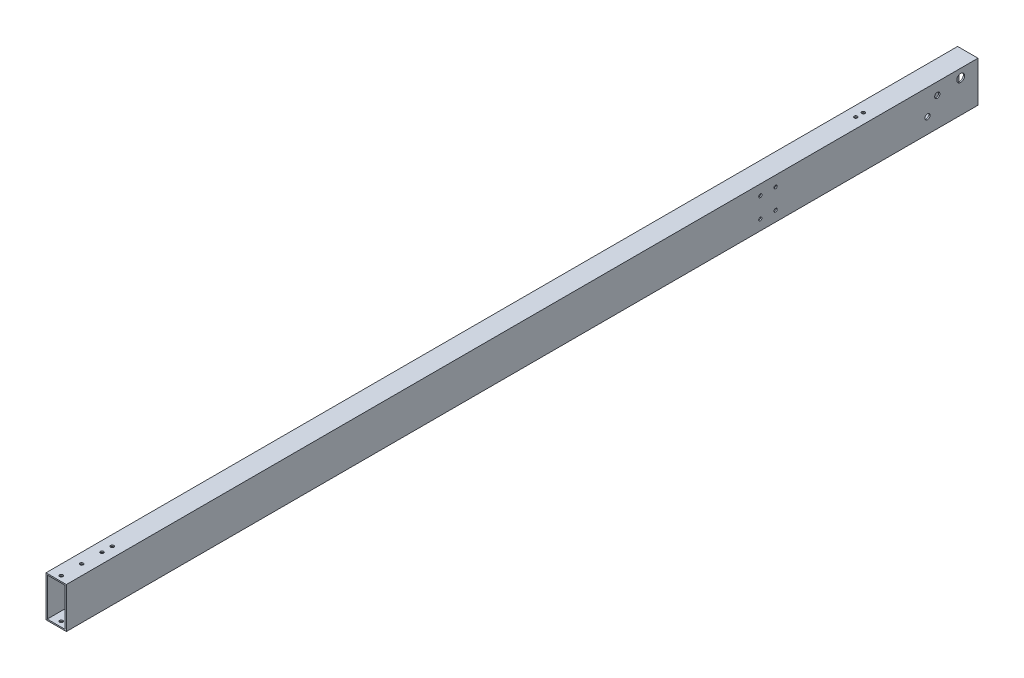
ISO-10303-21;
HEADER;
FILE_DESCRIPTION(('STEP AP214'),'2;1');
FILE_NAME('part.step','',(''),(''),'','','');
FILE_SCHEMA(('AUTOMOTIVE_DESIGN { 1 0 10303 214 1 1 1 1 }'));
ENDSEC;
DATA;
#1=APPLICATION_CONTEXT('core data for automotive mechanical design processes');
#2=APPLICATION_PROTOCOL_DEFINITION('international standard','automotive_design',2000,#1);
#3=PRODUCT_CONTEXT('',#1,'mechanical');
#4=PRODUCT('Part','Part','',(#3));
#5=PRODUCT_RELATED_PRODUCT_CATEGORY('part','',(#4));
#6=PRODUCT_DEFINITION_FORMATION('','',#4);
#7=PRODUCT_DEFINITION_CONTEXT('part definition',#1,'design');
#8=PRODUCT_DEFINITION('design','',#6,#7);
#9=PRODUCT_DEFINITION_SHAPE('','',#8);
#10=(LENGTH_UNIT() NAMED_UNIT(*) SI_UNIT(.MILLI.,.METRE.));
#11=(NAMED_UNIT(*) PLANE_ANGLE_UNIT() SI_UNIT($,.RADIAN.));
#12=(NAMED_UNIT(*) SI_UNIT($,.STERADIAN.) SOLID_ANGLE_UNIT());
#13=UNCERTAINTY_MEASURE_WITH_UNIT(LENGTH_MEASURE(1.E-05),#10,'distance_accuracy_value','');
#14=(GEOMETRIC_REPRESENTATION_CONTEXT(3) GLOBAL_UNCERTAINTY_ASSIGNED_CONTEXT((#13)) GLOBAL_UNIT_ASSIGNED_CONTEXT((#10,
#11,#12)) REPRESENTATION_CONTEXT('',''));
#15=CARTESIAN_POINT('',(0.,0.,0.));
#16=DIRECTION('',(0.,0.,1.));
#17=DIRECTION('',(1.,0.,0.));
#18=AXIS2_PLACEMENT_3D('',#15,#16,#17);
#19=CARTESIAN_POINT('',(0.,40.2844,21.59));
#20=DIRECTION('',(1.,0.,0.));
#21=DIRECTION('',(0.,0.,-1.));
#22=AXIS2_PLACEMENT_3D('',#19,#20,#21);
#23=CYLINDRICAL_SURFACE('',#22,4.9022);
#24=CARTESIAN_POINT('',(25.4,40.2844,21.59));
#25=DIRECTION('',(1.,0.,0.));
#26=DIRECTION('',(0.,0.,-1.));
#27=AXIS2_PLACEMENT_3D('',#24,#25,#26);
#28=CIRCLE('',#27,4.9022);
#29=CARTESIAN_POINT('',(25.4,40.2844,16.6878));
#30=VERTEX_POINT('',#29);
#31=EDGE_CURVE('E20',#30,#30,#28,.F.);
#32=ORIENTED_EDGE('',*,*,#31,.F.);
#33=EDGE_LOOP('',(#32));
#34=FACE_BOUND('',#33,.T.);
#35=CARTESIAN_POINT('',(23.8125,40.2844,21.59));
#36=DIRECTION('',(1.,0.,0.));
#37=DIRECTION('',(0.,0.,-1.));
#38=AXIS2_PLACEMENT_3D('',#35,#36,#37);
#39=CIRCLE('',#38,4.9022);
#40=CARTESIAN_POINT('',(23.8125,40.2844,16.6878));
#41=VERTEX_POINT('',#40);
#42=EDGE_CURVE('E253',#41,#41,#39,.F.);
#43=ORIENTED_EDGE('',*,*,#42,.T.);
#44=EDGE_LOOP('',(#43));
#45=FACE_BOUND('',#44,.T.);
#46=ADVANCED_FACE('F17',(#34,#45),#23,.F.);
#47=CARTESIAN_POINT('',(13.3600000001,19.05,62.992));
#48=DIRECTION('',(1.,0.,0.));
#49=DIRECTION('',(0.,0.,-1.));
#50=AXIS2_PLACEMENT_3D('',#47,#48,#49);
#51=CYLINDRICAL_SURFACE('',#50,3.2639);
#52=CARTESIAN_POINT('',(25.4,19.05,62.992));
#53=DIRECTION('',(1.,0.,0.));
#54=DIRECTION('',(0.,0.,-1.));
#55=AXIS2_PLACEMENT_3D('',#52,#53,#54);
#56=CIRCLE('',#55,3.2639);
#57=CARTESIAN_POINT('',(25.4,19.05,59.7281));
#58=VERTEX_POINT('',#57);
#59=EDGE_CURVE('E270',#58,#58,#56,.F.);
#60=ORIENTED_EDGE('',*,*,#59,.F.);
#61=EDGE_LOOP('',(#60));
#62=FACE_BOUND('',#61,.T.);
#63=CARTESIAN_POINT('',(23.8125,19.05,62.992));
#64=DIRECTION('',(1.,0.,0.));
#65=DIRECTION('',(0.,0.,-1.));
#66=AXIS2_PLACEMENT_3D('',#63,#64,#65);
#67=CIRCLE('',#66,3.2639);
#68=CARTESIAN_POINT('',(23.8125,19.05,59.7281));
#69=VERTEX_POINT('',#68);
#70=EDGE_CURVE('E250',#69,#69,#67,.F.);
#71=ORIENTED_EDGE('',*,*,#70,.T.);
#72=EDGE_LOOP('',(#71));
#73=FACE_BOUND('',#72,.T.);
#74=ADVANCED_FACE('F282',(#62,#73),#51,.F.);
#75=CARTESIAN_POINT('',(13.3600000001,36.1188,50.8));
#76=DIRECTION('',(1.,0.,0.));
#77=DIRECTION('',(0.,0.,-1.));
#78=AXIS2_PLACEMENT_3D('',#75,#76,#77);
#79=CYLINDRICAL_SURFACE('',#78,3.2639);
#80=CARTESIAN_POINT('',(25.4,36.1188,50.8));
#81=DIRECTION('',(1.,0.,0.));
#82=DIRECTION('',(0.,0.,-1.));
#83=AXIS2_PLACEMENT_3D('',#80,#81,#82);
#84=CIRCLE('',#83,3.2639);
#85=CARTESIAN_POINT('',(25.4,36.1188,47.5361));
#86=VERTEX_POINT('',#85);
#87=EDGE_CURVE('E268',#86,#86,#84,.F.);
#88=ORIENTED_EDGE('',*,*,#87,.F.);
#89=EDGE_LOOP('',(#88));
#90=FACE_BOUND('',#89,.T.);
#91=CARTESIAN_POINT('',(23.8125,36.1188,50.8));
#92=DIRECTION('',(1.,0.,0.));
#93=DIRECTION('',(0.,0.,-1.));
#94=AXIS2_PLACEMENT_3D('',#91,#92,#93);
#95=CIRCLE('',#94,3.2639);
#96=CARTESIAN_POINT('',(23.8125,36.1188,47.5361));
#97=VERTEX_POINT('',#96);
#98=EDGE_CURVE('E247',#97,#97,#95,.F.);
#99=ORIENTED_EDGE('',*,*,#98,.T.);
#100=EDGE_LOOP('',(#99));
#101=FACE_BOUND('',#100,.T.);
#102=ADVANCED_FACE('F441',(#90,#101),#79,.F.);
#103=CARTESIAN_POINT('',(13.3600000001,12.827,271.399));
#104=DIRECTION('',(1.,0.,0.));
#105=DIRECTION('',(0.,0.,-1.));
#106=AXIS2_PLACEMENT_3D('',#103,#104,#105);
#107=CYLINDRICAL_SURFACE('',#106,2.0193);
#108=CARTESIAN_POINT('',(25.4,12.827,271.399));
#109=DIRECTION('',(1.,0.,0.));
#110=DIRECTION('',(0.,0.,-1.));
#111=AXIS2_PLACEMENT_3D('',#108,#109,#110);
#112=CIRCLE('',#111,2.0193);
#113=CARTESIAN_POINT('',(25.4,12.827,269.3797));
#114=VERTEX_POINT('',#113);
#115=EDGE_CURVE('E265',#114,#114,#112,.F.);
#116=ORIENTED_EDGE('',*,*,#115,.F.);
#117=EDGE_LOOP('',(#116));
#118=FACE_BOUND('',#117,.T.);
#119=CARTESIAN_POINT('',(23.8125,12.827,271.399));
#120=DIRECTION('',(1.,0.,0.));
#121=DIRECTION('',(0.,0.,-1.));
#122=AXIS2_PLACEMENT_3D('',#119,#120,#121);
#123=CIRCLE('',#122,2.0193);
#124=CARTESIAN_POINT('',(23.8125,12.827,269.3797));
#125=VERTEX_POINT('',#124);
#126=EDGE_CURVE('E244',#125,#125,#123,.F.);
#127=ORIENTED_EDGE('',*,*,#126,.T.);
#128=EDGE_LOOP('',(#127));
#129=FACE_BOUND('',#128,.T.);
#130=ADVANCED_FACE('F437',(#118,#129),#107,.F.);
#131=CARTESIAN_POINT('',(13.3600000001,12.827,252.349));
#132=DIRECTION('',(1.,0.,0.));
#133=DIRECTION('',(0.,0.,-1.));
#134=AXIS2_PLACEMENT_3D('',#131,#132,#133);
#135=CYLINDRICAL_SURFACE('',#134,2.0193);
#136=CARTESIAN_POINT('',(25.4,12.827,252.349));
#137=DIRECTION('',(1.,0.,0.));
#138=DIRECTION('',(0.,0.,-1.));
#139=AXIS2_PLACEMENT_3D('',#136,#137,#138);
#140=CIRCLE('',#139,2.0193);
#141=CARTESIAN_POINT('',(25.4,12.827,250.3297));
#142=VERTEX_POINT('',#141);
#143=EDGE_CURVE('E262',#142,#142,#140,.F.);
#144=ORIENTED_EDGE('',*,*,#143,.F.);
#145=EDGE_LOOP('',(#144));
#146=FACE_BOUND('',#145,.T.);
#147=CARTESIAN_POINT('',(23.8125,12.827,252.349));
#148=DIRECTION('',(1.,0.,0.));
#149=DIRECTION('',(0.,0.,-1.));
#150=AXIS2_PLACEMENT_3D('',#147,#148,#149);
#151=CIRCLE('',#150,2.0193);
#152=CARTESIAN_POINT('',(23.8125,12.827,250.3297));
#153=VERTEX_POINT('',#152);
#154=EDGE_CURVE('E241',#153,#153,#151,.F.);
#155=ORIENTED_EDGE('',*,*,#154,.T.);
#156=EDGE_LOOP('',(#155));
#157=FACE_BOUND('',#156,.T.);
#158=ADVANCED_FACE('F433',(#146,#157),#135,.F.);
#159=CARTESIAN_POINT('',(13.3600000001,37.973,271.399));
#160=DIRECTION('',(1.,0.,0.));
#161=DIRECTION('',(0.,0.,-1.));
#162=AXIS2_PLACEMENT_3D('',#159,#160,#161);
#163=CYLINDRICAL_SURFACE('',#162,2.0193);
#164=CARTESIAN_POINT('',(25.4,37.973,271.399));
#165=DIRECTION('',(1.,0.,0.));
#166=DIRECTION('',(0.,0.,-1.));
#167=AXIS2_PLACEMENT_3D('',#164,#165,#166);
#168=CIRCLE('',#167,2.0193);
#169=CARTESIAN_POINT('',(25.4,37.973,269.3797));
#170=VERTEX_POINT('',#169);
#171=EDGE_CURVE('E259',#170,#170,#168,.F.);
#172=ORIENTED_EDGE('',*,*,#171,.F.);
#173=EDGE_LOOP('',(#172));
#174=FACE_BOUND('',#173,.T.);
#175=CARTESIAN_POINT('',(23.8125,37.973,271.399));
#176=DIRECTION('',(1.,0.,0.));
#177=DIRECTION('',(0.,0.,-1.));
#178=AXIS2_PLACEMENT_3D('',#175,#176,#177);
#179=CIRCLE('',#178,2.0193);
#180=CARTESIAN_POINT('',(23.8125,37.973,269.3797));
#181=VERTEX_POINT('',#180);
#182=EDGE_CURVE('E238',#181,#181,#179,.F.);
#183=ORIENTED_EDGE('',*,*,#182,.T.);
#184=EDGE_LOOP('',(#183));
#185=FACE_BOUND('',#184,.T.);
#186=ADVANCED_FACE('F425',(#174,#185),#163,.F.);
#187=CARTESIAN_POINT('',(13.3600000001,37.973,252.349));
#188=DIRECTION('',(1.,0.,0.));
#189=DIRECTION('',(0.,0.,-1.));
#190=AXIS2_PLACEMENT_3D('',#187,#188,#189);
#191=CYLINDRICAL_SURFACE('',#190,2.0193);
#192=CARTESIAN_POINT('',(25.4,37.973,252.349));
#193=DIRECTION('',(1.,0.,0.));
#194=DIRECTION('',(0.,0.,-1.));
#195=AXIS2_PLACEMENT_3D('',#192,#193,#194);
#196=CIRCLE('',#195,2.0193);
#197=CARTESIAN_POINT('',(25.4,37.973,250.3297));
#198=VERTEX_POINT('',#197);
#199=EDGE_CURVE('E256',#198,#198,#196,.F.);
#200=ORIENTED_EDGE('',*,*,#199,.F.);
#201=EDGE_LOOP('',(#200));
#202=FACE_BOUND('',#201,.T.);
#203=CARTESIAN_POINT('',(23.8125,37.973,252.349));
#204=DIRECTION('',(1.,0.,0.));
#205=DIRECTION('',(0.,0.,-1.));
#206=AXIS2_PLACEMENT_3D('',#203,#204,#205);
#207=CIRCLE('',#206,2.0193);
#208=CARTESIAN_POINT('',(23.8125,37.973,250.3297));
#209=VERTEX_POINT('',#208);
#210=EDGE_CURVE('E99',#209,#209,#207,.F.);
#211=ORIENTED_EDGE('',*,*,#210,.T.);
#212=EDGE_LOOP('',(#211));
#213=FACE_BOUND('',#212,.T.);
#214=ADVANCED_FACE('F415',(#202,#213),#191,.F.);
#215=CARTESIAN_POINT('',(12.7,24.7399999987,1079.5));
#216=DIRECTION('',(0.,1.,0.));
#217=DIRECTION('',(0.,0.,1.));
#218=AXIS2_PLACEMENT_3D('',#215,#216,#217);
#219=CYLINDRICAL_SURFACE('',#218,2.0193);
#220=CARTESIAN_POINT('',(12.7,50.8,1079.5));
#221=DIRECTION('',(0.,1.,0.));
#222=DIRECTION('',(0.,0.,1.));
#223=AXIS2_PLACEMENT_3D('',#220,#221,#222);
#224=CIRCLE('',#223,2.0193);
#225=CARTESIAN_POINT('',(12.7,50.8,1081.5193));
#226=VERTEX_POINT('',#225);
#227=EDGE_CURVE('E119',#226,#226,#224,.F.);
#228=ORIENTED_EDGE('',*,*,#227,.F.);
#229=EDGE_LOOP('',(#228));
#230=FACE_BOUND('',#229,.T.);
#231=CARTESIAN_POINT('',(12.7,49.2125,1079.5));
#232=DIRECTION('',(0.,1.,0.));
#233=DIRECTION('',(0.,0.,1.));
#234=AXIS2_PLACEMENT_3D('',#231,#232,#233);
#235=CIRCLE('',#234,2.0193);
#236=CARTESIAN_POINT('',(12.7,49.2125,1081.5193));
#237=VERTEX_POINT('',#236);
#238=EDGE_CURVE('E125',#237,#237,#235,.T.);
#239=ORIENTED_EDGE('',*,*,#238,.F.);
#240=EDGE_LOOP('',(#239));
#241=FACE_BOUND('',#240,.T.);
#242=ADVANCED_FACE('F412',(#230,#241),#219,.F.);
#243=CARTESIAN_POINT('',(12.7,24.7399999987,1066.8));
#244=DIRECTION('',(0.,1.,0.));
#245=DIRECTION('',(0.,0.,1.));
#246=AXIS2_PLACEMENT_3D('',#243,#244,#245);
#247=CYLINDRICAL_SURFACE('',#246,2.0193);
#248=CARTESIAN_POINT('',(12.7,50.8,1066.8));
#249=DIRECTION('',(0.,1.,0.));
#250=DIRECTION('',(0.,0.,1.));
#251=AXIS2_PLACEMENT_3D('',#248,#249,#250);
#252=CIRCLE('',#251,2.0193);
#253=CARTESIAN_POINT('',(12.7,50.8,1068.8193));
#254=VERTEX_POINT('',#253);
#255=EDGE_CURVE('E199',#254,#254,#252,.F.);
#256=ORIENTED_EDGE('',*,*,#255,.F.);
#257=EDGE_LOOP('',(#256));
#258=FACE_BOUND('',#257,.T.);
#259=CARTESIAN_POINT('',(12.7,49.2125,1066.8));
#260=DIRECTION('',(0.,1.,0.));
#261=DIRECTION('',(0.,0.,1.));
#262=AXIS2_PLACEMENT_3D('',#259,#260,#261);
#263=CIRCLE('',#262,2.0193);
#264=CARTESIAN_POINT('',(12.7,49.2125,1068.8193));
#265=VERTEX_POINT('',#264);
#266=EDGE_CURVE('E215',#265,#265,#263,.T.);
#267=ORIENTED_EDGE('',*,*,#266,.F.);
#268=EDGE_LOOP('',(#267));
#269=FACE_BOUND('',#268,.T.);
#270=ADVANCED_FACE('F414',(#258,#269),#247,.F.);
#271=CARTESIAN_POINT('',(12.7,24.7399999987,1130.3));
#272=DIRECTION('',(0.,1.,0.));
#273=DIRECTION('',(0.,0.,1.));
#274=AXIS2_PLACEMENT_3D('',#271,#272,#273);
#275=CYLINDRICAL_SURFACE('',#274,2.0193);
#276=CARTESIAN_POINT('',(12.7,50.8,1130.3));
#277=DIRECTION('',(0.,1.,0.));
#278=DIRECTION('',(0.,0.,1.));
#279=AXIS2_PLACEMENT_3D('',#276,#277,#278);
#280=CIRCLE('',#279,2.0193);
#281=CARTESIAN_POINT('',(12.7,50.8,1132.3193));
#282=VERTEX_POINT('',#281);
#283=EDGE_CURVE('E196',#282,#282,#280,.F.);
#284=ORIENTED_EDGE('',*,*,#283,.F.);
#285=EDGE_LOOP('',(#284));
#286=FACE_BOUND('',#285,.T.);
#287=CARTESIAN_POINT('',(12.7,49.2125,1130.3));
#288=DIRECTION('',(0.,1.,0.));
#289=DIRECTION('',(0.,0.,1.));
#290=AXIS2_PLACEMENT_3D('',#287,#288,#289);
#291=CIRCLE('',#290,2.0193);
#292=CARTESIAN_POINT('',(12.7,49.2125,1132.3193));
#293=VERTEX_POINT('',#292);
#294=EDGE_CURVE('E212',#293,#293,#291,.T.);
#295=ORIENTED_EDGE('',*,*,#294,.F.);
#296=EDGE_LOOP('',(#295));
#297=FACE_BOUND('',#296,.T.);
#298=ADVANCED_FACE('F422',(#286,#297),#275,.F.);
#299=CARTESIAN_POINT('',(12.7,24.7399999987,1104.9));
#300=DIRECTION('',(0.,1.,0.));
#301=DIRECTION('',(0.,0.,1.));
#302=AXIS2_PLACEMENT_3D('',#299,#300,#301);
#303=CYLINDRICAL_SURFACE('',#302,2.0193);
#304=CARTESIAN_POINT('',(12.7,50.8,1104.9));
#305=DIRECTION('',(0.,1.,0.));
#306=DIRECTION('',(0.,0.,1.));
#307=AXIS2_PLACEMENT_3D('',#304,#305,#306);
#308=CIRCLE('',#307,2.0193);
#309=CARTESIAN_POINT('',(12.7,50.8,1106.9193));
#310=VERTEX_POINT('',#309);
#311=EDGE_CURVE('E193',#310,#310,#308,.F.);
#312=ORIENTED_EDGE('',*,*,#311,.F.);
#313=EDGE_LOOP('',(#312));
#314=FACE_BOUND('',#313,.T.);
#315=CARTESIAN_POINT('',(12.7,49.2125,1104.9));
#316=DIRECTION('',(0.,1.,0.));
#317=DIRECTION('',(0.,0.,1.));
#318=AXIS2_PLACEMENT_3D('',#315,#316,#317);
#319=CIRCLE('',#318,2.0193);
#320=CARTESIAN_POINT('',(12.7,49.2125,1106.9193));
#321=VERTEX_POINT('',#320);
#322=EDGE_CURVE('E209',#321,#321,#319,.T.);
#323=ORIENTED_EDGE('',*,*,#322,.F.);
#324=EDGE_LOOP('',(#323));
#325=FACE_BOUND('',#324,.T.);
#326=ADVANCED_FACE('F499',(#314,#325),#303,.F.);
#327=CARTESIAN_POINT('',(12.7,26.0600007629,130.175));
#328=DIRECTION('',(0.,1.,0.));
#329=DIRECTION('',(0.,0.,1.));
#330=AXIS2_PLACEMENT_3D('',#327,#328,#329);
#331=CYLINDRICAL_SURFACE('',#330,2.0193);
#332=CARTESIAN_POINT('',(12.7,50.8,130.175));
#333=DIRECTION('',(0.,1.,0.));
#334=DIRECTION('',(0.,0.,1.));
#335=AXIS2_PLACEMENT_3D('',#332,#333,#334);
#336=CIRCLE('',#335,2.0193);
#337=CARTESIAN_POINT('',(12.7,50.8,132.1943));
#338=VERTEX_POINT('',#337);
#339=EDGE_CURVE('E190',#338,#338,#336,.F.);
#340=ORIENTED_EDGE('',*,*,#339,.F.);
#341=EDGE_LOOP('',(#340));
#342=FACE_BOUND('',#341,.T.);
#343=CARTESIAN_POINT('',(12.7,49.2125,130.175));
#344=DIRECTION('',(0.,1.,0.));
#345=DIRECTION('',(0.,0.,1.));
#346=AXIS2_PLACEMENT_3D('',#343,#344,#345);
#347=CIRCLE('',#346,2.0193);
#348=CARTESIAN_POINT('',(12.7,49.2125,132.1943));
#349=VERTEX_POINT('',#348);
#350=EDGE_CURVE('E206',#349,#349,#347,.T.);
#351=ORIENTED_EDGE('',*,*,#350,.F.);
#352=EDGE_LOOP('',(#351));
#353=FACE_BOUND('',#352,.T.);
#354=ADVANCED_FACE('F508',(#342,#353),#331,.F.);
#355=CARTESIAN_POINT('',(12.7,26.0600007629,139.7));
#356=DIRECTION('',(0.,1.,0.));
#357=DIRECTION('',(0.,0.,1.));
#358=AXIS2_PLACEMENT_3D('',#355,#356,#357);
#359=CYLINDRICAL_SURFACE('',#358,2.0193);
#360=CARTESIAN_POINT('',(12.7,50.8,139.7));
#361=DIRECTION('',(0.,1.,0.));
#362=DIRECTION('',(0.,0.,1.));
#363=AXIS2_PLACEMENT_3D('',#360,#361,#362);
#364=CIRCLE('',#363,2.0193);
#365=CARTESIAN_POINT('',(12.7,50.8,141.7193));
#366=VERTEX_POINT('',#365);
#367=EDGE_CURVE('E115',#366,#366,#364,.F.);
#368=ORIENTED_EDGE('',*,*,#367,.F.);
#369=EDGE_LOOP('',(#368));
#370=FACE_BOUND('',#369,.T.);
#371=CARTESIAN_POINT('',(12.7,49.2125,139.7));
#372=DIRECTION('',(0.,1.,0.));
#373=DIRECTION('',(0.,0.,1.));
#374=AXIS2_PLACEMENT_3D('',#371,#372,#373);
#375=CIRCLE('',#374,2.0193);
#376=CARTESIAN_POINT('',(12.7,49.2125,141.7193));
#377=VERTEX_POINT('',#376);
#378=EDGE_CURVE('E124',#377,#377,#375,.T.);
#379=ORIENTED_EDGE('',*,*,#378,.F.);
#380=EDGE_LOOP('',(#379));
#381=FACE_BOUND('',#380,.T.);
#382=ADVANCED_FACE('F518',(#370,#381),#359,.F.);
#383=CARTESIAN_POINT('',(12.7,24.7399999987,1079.5));
#384=DIRECTION('',(0.,1.,0.));
#385=DIRECTION('',(0.,0.,1.));
#386=AXIS2_PLACEMENT_3D('',#383,#384,#385);
#387=CYLINDRICAL_SURFACE('',#386,2.0193);
#388=CARTESIAN_POINT('',(12.7,0.,1079.5));
#389=DIRECTION('',(0.,1.,0.));
#390=DIRECTION('',(0.,0.,1.));
#391=AXIS2_PLACEMENT_3D('',#388,#389,#390);
#392=CIRCLE('',#391,2.0193);
#393=CARTESIAN_POINT('',(12.7,0.,1081.5193));
#394=VERTEX_POINT('',#393);
#395=EDGE_CURVE('E184',#394,#394,#392,.T.);
#396=ORIENTED_EDGE('',*,*,#395,.F.);
#397=EDGE_LOOP('',(#396));
#398=FACE_BOUND('',#397,.T.);
#399=CARTESIAN_POINT('',(12.7,1.5875,1079.5));
#400=DIRECTION('',(0.,1.,0.));
#401=DIRECTION('',(0.,0.,1.));
#402=AXIS2_PLACEMENT_3D('',#399,#400,#401);
#403=CIRCLE('',#402,2.0193);
#404=CARTESIAN_POINT('',(12.7,1.5875,1081.5193));
#405=VERTEX_POINT('',#404);
#406=EDGE_CURVE('E98',#405,#405,#403,.F.);
#407=ORIENTED_EDGE('',*,*,#406,.F.);
#408=EDGE_LOOP('',(#407));
#409=FACE_BOUND('',#408,.T.);
#410=ADVANCED_FACE('F528',(#398,#409),#387,.F.);
#411=CARTESIAN_POINT('',(12.7,24.7399999987,1066.8));
#412=DIRECTION('',(0.,1.,0.));
#413=DIRECTION('',(0.,0.,1.));
#414=AXIS2_PLACEMENT_3D('',#411,#412,#413);
#415=CYLINDRICAL_SURFACE('',#414,2.0193);
#416=CARTESIAN_POINT('',(12.7,0.,1066.8));
#417=DIRECTION('',(0.,1.,0.));
#418=DIRECTION('',(0.,0.,1.));
#419=AXIS2_PLACEMENT_3D('',#416,#417,#418);
#420=CIRCLE('',#419,2.0193);
#421=CARTESIAN_POINT('',(12.7,0.,1068.8193));
#422=VERTEX_POINT('',#421);
#423=EDGE_CURVE('E181',#422,#422,#420,.T.);
#424=ORIENTED_EDGE('',*,*,#423,.F.);
#425=EDGE_LOOP('',(#424));
#426=FACE_BOUND('',#425,.T.);
#427=CARTESIAN_POINT('',(12.7,1.5875,1066.8));
#428=DIRECTION('',(0.,1.,0.));
#429=DIRECTION('',(0.,0.,1.));
#430=AXIS2_PLACEMENT_3D('',#427,#428,#429);
#431=CIRCLE('',#430,2.0193);
#432=CARTESIAN_POINT('',(12.7,1.5875,1068.8193));
#433=VERTEX_POINT('',#432);
#434=EDGE_CURVE('E231',#433,#433,#431,.F.);
#435=ORIENTED_EDGE('',*,*,#434,.F.);
#436=EDGE_LOOP('',(#435));
#437=FACE_BOUND('',#436,.T.);
#438=ADVANCED_FACE('F538',(#426,#437),#415,.F.);
#439=CARTESIAN_POINT('',(12.7,24.7399999987,1130.3));
#440=DIRECTION('',(0.,1.,0.));
#441=DIRECTION('',(0.,0.,1.));
#442=AXIS2_PLACEMENT_3D('',#439,#440,#441);
#443=CYLINDRICAL_SURFACE('',#442,2.0193);
#444=CARTESIAN_POINT('',(12.7,0.,1130.3));
#445=DIRECTION('',(0.,1.,0.));
#446=DIRECTION('',(0.,0.,1.));
#447=AXIS2_PLACEMENT_3D('',#444,#445,#446);
#448=CIRCLE('',#447,2.0193);
#449=CARTESIAN_POINT('',(12.7,0.,1132.3193));
#450=VERTEX_POINT('',#449);
#451=EDGE_CURVE('E178',#450,#450,#448,.T.);
#452=ORIENTED_EDGE('',*,*,#451,.F.);
#453=EDGE_LOOP('',(#452));
#454=FACE_BOUND('',#453,.T.);
#455=CARTESIAN_POINT('',(12.7,1.5875,1130.3));
#456=DIRECTION('',(0.,1.,0.));
#457=DIRECTION('',(0.,0.,1.));
#458=AXIS2_PLACEMENT_3D('',#455,#456,#457);
#459=CIRCLE('',#458,2.0193);
#460=CARTESIAN_POINT('',(12.7,1.5875,1132.3193));
#461=VERTEX_POINT('',#460);
#462=EDGE_CURVE('E228',#461,#461,#459,.F.);
#463=ORIENTED_EDGE('',*,*,#462,.F.);
#464=EDGE_LOOP('',(#463));
#465=FACE_BOUND('',#464,.T.);
#466=ADVANCED_FACE('F548',(#454,#465),#443,.F.);
#467=CARTESIAN_POINT('',(12.7,24.7399999987,1104.9));
#468=DIRECTION('',(0.,1.,0.));
#469=DIRECTION('',(0.,0.,1.));
#470=AXIS2_PLACEMENT_3D('',#467,#468,#469);
#471=CYLINDRICAL_SURFACE('',#470,2.0193);
#472=CARTESIAN_POINT('',(12.7,0.,1104.9));
#473=DIRECTION('',(0.,1.,0.));
#474=DIRECTION('',(0.,0.,1.));
#475=AXIS2_PLACEMENT_3D('',#472,#473,#474);
#476=CIRCLE('',#475,2.0193);
#477=CARTESIAN_POINT('',(12.7,0.,1106.9193));
#478=VERTEX_POINT('',#477);
#479=EDGE_CURVE('E175',#478,#478,#476,.T.);
#480=ORIENTED_EDGE('',*,*,#479,.F.);
#481=EDGE_LOOP('',(#480));
#482=FACE_BOUND('',#481,.T.);
#483=CARTESIAN_POINT('',(12.7,1.5875,1104.9));
#484=DIRECTION('',(0.,1.,0.));
#485=DIRECTION('',(0.,0.,1.));
#486=AXIS2_PLACEMENT_3D('',#483,#484,#485);
#487=CIRCLE('',#486,2.0193);
#488=CARTESIAN_POINT('',(12.7,1.5875,1106.9193));
#489=VERTEX_POINT('',#488);
#490=EDGE_CURVE('E225',#489,#489,#487,.F.);
#491=ORIENTED_EDGE('',*,*,#490,.F.);
#492=EDGE_LOOP('',(#491));
#493=FACE_BOUND('',#492,.T.);
#494=ADVANCED_FACE('F558',(#482,#493),#471,.F.);
#495=CARTESIAN_POINT('',(12.7,26.0600007629,130.175));
#496=DIRECTION('',(0.,1.,0.));
#497=DIRECTION('',(0.,0.,1.));
#498=AXIS2_PLACEMENT_3D('',#495,#496,#497);
#499=CYLINDRICAL_SURFACE('',#498,2.0193);
#500=CARTESIAN_POINT('',(12.7,0.,130.175));
#501=DIRECTION('',(0.,1.,0.));
#502=DIRECTION('',(0.,0.,1.));
#503=AXIS2_PLACEMENT_3D('',#500,#501,#502);
#504=CIRCLE('',#503,2.0193);
#505=CARTESIAN_POINT('',(12.7,0.,132.1943));
#506=VERTEX_POINT('',#505);
#507=EDGE_CURVE('E172',#506,#506,#504,.T.);
#508=ORIENTED_EDGE('',*,*,#507,.F.);
#509=EDGE_LOOP('',(#508));
#510=FACE_BOUND('',#509,.T.);
#511=CARTESIAN_POINT('',(12.7,1.5875,130.175));
#512=DIRECTION('',(0.,1.,0.));
#513=DIRECTION('',(0.,0.,1.));
#514=AXIS2_PLACEMENT_3D('',#511,#512,#513);
#515=CIRCLE('',#514,2.0193);
#516=CARTESIAN_POINT('',(12.7,1.5875,132.1943));
#517=VERTEX_POINT('',#516);
#518=EDGE_CURVE('E222',#517,#517,#515,.F.);
#519=ORIENTED_EDGE('',*,*,#518,.F.);
#520=EDGE_LOOP('',(#519));
#521=FACE_BOUND('',#520,.T.);
#522=ADVANCED_FACE('F568',(#510,#521),#499,.F.);
#523=CARTESIAN_POINT('',(12.7,26.0600007629,139.7));
#524=DIRECTION('',(0.,1.,0.));
#525=DIRECTION('',(0.,0.,1.));
#526=AXIS2_PLACEMENT_3D('',#523,#524,#525);
#527=CYLINDRICAL_SURFACE('',#526,2.0193);
#528=CARTESIAN_POINT('',(12.7,0.,139.7));
#529=DIRECTION('',(0.,1.,0.));
#530=DIRECTION('',(0.,0.,1.));
#531=AXIS2_PLACEMENT_3D('',#528,#529,#530);
#532=CIRCLE('',#531,2.0193);
#533=CARTESIAN_POINT('',(12.7,0.,141.7193));
#534=VERTEX_POINT('',#533);
#535=EDGE_CURVE('E169',#534,#534,#532,.T.);
#536=ORIENTED_EDGE('',*,*,#535,.F.);
#537=EDGE_LOOP('',(#536));
#538=FACE_BOUND('',#537,.T.);
#539=CARTESIAN_POINT('',(12.7,1.5875,139.7));
#540=DIRECTION('',(0.,1.,0.));
#541=DIRECTION('',(0.,0.,1.));
#542=AXIS2_PLACEMENT_3D('',#539,#540,#541);
#543=CIRCLE('',#542,2.0193);
#544=CARTESIAN_POINT('',(12.7,1.5875,141.7193));
#545=VERTEX_POINT('',#544);
#546=EDGE_CURVE('E126',#545,#545,#543,.F.);
#547=ORIENTED_EDGE('',*,*,#546,.F.);
#548=EDGE_LOOP('',(#547));
#549=FACE_BOUND('',#548,.T.);
#550=ADVANCED_FACE('F296',(#538,#549),#527,.F.);
#551=CARTESIAN_POINT('',(25.4,0.,0.));
#552=DIRECTION('',(1.,0.,0.));
#553=DIRECTION('',(0.,0.,-1.));
#554=AXIS2_PLACEMENT_3D('',#551,#552,#553);
#555=PLANE('',#554);
#556=ORIENTED_EDGE('',*,*,#199,.T.);
#557=EDGE_LOOP('',(#556));
#558=FACE_BOUND('',#557,.T.);
#559=ORIENTED_EDGE('',*,*,#171,.T.);
#560=EDGE_LOOP('',(#559));
#561=FACE_BOUND('',#560,.T.);
#562=ORIENTED_EDGE('',*,*,#143,.T.);
#563=EDGE_LOOP('',(#562));
#564=FACE_BOUND('',#563,.T.);
#565=ORIENTED_EDGE('',*,*,#115,.T.);
#566=EDGE_LOOP('',(#565));
#567=FACE_BOUND('',#566,.T.);
#568=ORIENTED_EDGE('',*,*,#87,.T.);
#569=EDGE_LOOP('',(#568));
#570=FACE_BOUND('',#569,.T.);
#571=ORIENTED_EDGE('',*,*,#59,.T.);
#572=EDGE_LOOP('',(#571));
#573=FACE_BOUND('',#572,.T.);
#574=ORIENTED_EDGE('',*,*,#31,.T.);
#575=EDGE_LOOP('',(#574));
#576=FACE_BOUND('',#575,.T.);
#577=DIRECTION('',(0.,0.,1.));
#578=VECTOR('',#577,1.);
#579=CARTESIAN_POINT('',(25.4,50.8,0.));
#580=LINE('',#579,#578);
#581=CARTESIAN_POINT('',(25.4,50.8,1136.65));
#582=VERTEX_POINT('',#581);
#583=CARTESIAN_POINT('',(25.4,50.8,0.));
#584=VERTEX_POINT('',#583);
#585=EDGE_CURVE('E116',#582,#584,#580,.F.);
#586=ORIENTED_EDGE('',*,*,#585,.F.);
#587=DIRECTION('',(0.,1.,0.));
#588=VECTOR('',#587,1.);
#589=CARTESIAN_POINT('',(25.4,0.,1136.65));
#590=LINE('',#589,#588);
#591=CARTESIAN_POINT('',(25.4,0.,1136.65));
#592=VERTEX_POINT('',#591);
#593=EDGE_CURVE('E388',#592,#582,#590,.T.);
#594=ORIENTED_EDGE('',*,*,#593,.F.);
#595=DIRECTION('',(0.,0.,-1.));
#596=VECTOR('',#595,1.);
#597=CARTESIAN_POINT('',(25.4,0.,0.));
#598=LINE('',#597,#596);
#599=CARTESIAN_POINT('',(25.4,0.,0.));
#600=VERTEX_POINT('',#599);
#601=EDGE_CURVE('E187',#600,#592,#598,.F.);
#602=ORIENTED_EDGE('',*,*,#601,.F.);
#603=DIRECTION('',(0.,1.,0.));
#604=VECTOR('',#603,1.);
#605=CARTESIAN_POINT('',(25.4,0.,0.));
#606=LINE('',#605,#604);
#607=EDGE_CURVE('E112',#600,#584,#606,.T.);
#608=ORIENTED_EDGE('',*,*,#607,.T.);
#609=EDGE_LOOP('',(#586,#594,#602,#608));
#610=FACE_BOUND('',#609,.T.);
#611=ADVANCED_FACE('F277',(#558,#561,#564,#567,#570,#573,#576,#610),#555,.T.);
#612=CARTESIAN_POINT('',(23.8125,1.5875,0.));
#613=DIRECTION('',(1.,0.,0.));
#614=DIRECTION('',(0.,0.,-1.));
#615=AXIS2_PLACEMENT_3D('',#612,#613,#614);
#616=PLANE('',#615);
#617=ORIENTED_EDGE('',*,*,#210,.F.);
#618=EDGE_LOOP('',(#617));
#619=FACE_BOUND('',#618,.T.);
#620=ORIENTED_EDGE('',*,*,#182,.F.);
#621=EDGE_LOOP('',(#620));
#622=FACE_BOUND('',#621,.T.);
#623=ORIENTED_EDGE('',*,*,#154,.F.);
#624=EDGE_LOOP('',(#623));
#625=FACE_BOUND('',#624,.T.);
#626=ORIENTED_EDGE('',*,*,#126,.F.);
#627=EDGE_LOOP('',(#626));
#628=FACE_BOUND('',#627,.T.);
#629=ORIENTED_EDGE('',*,*,#98,.F.);
#630=EDGE_LOOP('',(#629));
#631=FACE_BOUND('',#630,.T.);
#632=ORIENTED_EDGE('',*,*,#70,.F.);
#633=EDGE_LOOP('',(#632));
#634=FACE_BOUND('',#633,.T.);
#635=ORIENTED_EDGE('',*,*,#42,.F.);
#636=EDGE_LOOP('',(#635));
#637=FACE_BOUND('',#636,.T.);
#638=DIRECTION('',(0.,0.,-1.));
#639=VECTOR('',#638,1.);
#640=CARTESIAN_POINT('',(23.8125,49.2125,0.));
#641=LINE('',#640,#639);
#642=CARTESIAN_POINT('',(23.8125,49.2125,0.));
#643=VERTEX_POINT('',#642);
#644=CARTESIAN_POINT('',(23.8125,49.2125,1136.65));
#645=VERTEX_POINT('',#644);
#646=EDGE_CURVE('E84',#643,#645,#641,.F.);
#647=ORIENTED_EDGE('',*,*,#646,.F.);
#648=DIRECTION('',(0.,1.,0.));
#649=VECTOR('',#648,1.);
#650=CARTESIAN_POINT('',(23.8125,0.,0.));
#651=LINE('',#650,#649);
#652=CARTESIAN_POINT('',(23.8125,1.5875,0.));
#653=VERTEX_POINT('',#652);
#654=EDGE_CURVE('E78',#643,#653,#651,.F.);
#655=ORIENTED_EDGE('',*,*,#654,.T.);
#656=DIRECTION('',(0.,0.,1.));
#657=VECTOR('',#656,1.);
#658=CARTESIAN_POINT('',(23.8125,1.5875,0.));
#659=LINE('',#658,#657);
#660=CARTESIAN_POINT('',(23.8125,1.5875,1136.65));
#661=VERTEX_POINT('',#660);
#662=EDGE_CURVE('E81',#661,#653,#659,.F.);
#663=ORIENTED_EDGE('',*,*,#662,.F.);
#664=DIRECTION('',(0.,1.,0.));
#665=VECTOR('',#664,1.);
#666=CARTESIAN_POINT('',(23.8125,0.,1136.65));
#667=LINE('',#666,#665);
#668=EDGE_CURVE('E375',#645,#661,#667,.F.);
#669=ORIENTED_EDGE('',*,*,#668,.F.);
#670=EDGE_LOOP('',(#647,#655,#663,#669));
#671=FACE_BOUND('',#670,.T.);
#672=ADVANCED_FACE('F80',(#619,#622,#625,#628,#631,#634,#637,#671),#616,.F.);
#673=CARTESIAN_POINT('',(23.8125,1.5875,0.));
#674=DIRECTION('',(0.,1.,0.));
#675=DIRECTION('',(0.,0.,1.));
#676=AXIS2_PLACEMENT_3D('',#673,#674,#675);
#677=PLANE('',#676);
#678=ORIENTED_EDGE('',*,*,#546,.T.);
#679=EDGE_LOOP('',(#678));
#680=FACE_BOUND('',#679,.T.);
#681=ORIENTED_EDGE('',*,*,#518,.T.);
#682=EDGE_LOOP('',(#681));
#683=FACE_BOUND('',#682,.T.);
#684=ORIENTED_EDGE('',*,*,#490,.T.);
#685=EDGE_LOOP('',(#684));
#686=FACE_BOUND('',#685,.T.);
#687=ORIENTED_EDGE('',*,*,#462,.T.);
#688=EDGE_LOOP('',(#687));
#689=FACE_BOUND('',#688,.T.);
#690=ORIENTED_EDGE('',*,*,#434,.T.);
#691=EDGE_LOOP('',(#690));
#692=FACE_BOUND('',#691,.T.);
#693=ORIENTED_EDGE('',*,*,#406,.T.);
#694=EDGE_LOOP('',(#693));
#695=FACE_BOUND('',#694,.T.);
#696=DIRECTION('',(0.,0.,1.));
#697=VECTOR('',#696,1.);
#698=CARTESIAN_POINT('',(1.5875,1.5875,0.));
#699=LINE('',#698,#697);
#700=CARTESIAN_POINT('',(1.5875,1.5875,0.));
#701=VERTEX_POINT('',#700);
#702=CARTESIAN_POINT('',(1.5875,1.5875,1136.65));
#703=VERTEX_POINT('',#702);
#704=EDGE_CURVE('E120',#701,#703,#699,.T.);
#705=ORIENTED_EDGE('',*,*,#704,.T.);
#706=DIRECTION('',(1.,0.,0.));
#707=VECTOR('',#706,1.);
#708=CARTESIAN_POINT('',(0.,1.5875,1136.65));
#709=LINE('',#708,#707);
#710=EDGE_CURVE('E96',#661,#703,#709,.F.);
#711=ORIENTED_EDGE('',*,*,#710,.F.);
#712=ORIENTED_EDGE('',*,*,#662,.T.);
#713=DIRECTION('',(1.,0.,0.));
#714=VECTOR('',#713,1.);
#715=CARTESIAN_POINT('',(0.,1.5875,0.));
#716=LINE('',#715,#714);
#717=EDGE_CURVE('E89',#653,#701,#716,.F.);
#718=ORIENTED_EDGE('',*,*,#717,.T.);
#719=EDGE_LOOP('',(#705,#711,#712,#718));
#720=FACE_BOUND('',#719,.T.);
#721=ADVANCED_FACE('F93',(#680,#683,#686,#689,#692,#695,#720),#677,.T.);
#722=CARTESIAN_POINT('',(1.5875,49.2125,0.));
#723=DIRECTION('',(0.,-1.,0.));
#724=DIRECTION('',(0.,0.,-1.));
#725=AXIS2_PLACEMENT_3D('',#722,#723,#724);
#726=PLANE('',#725);
#727=ORIENTED_EDGE('',*,*,#378,.T.);
#728=EDGE_LOOP('',(#727));
#729=FACE_BOUND('',#728,.T.);
#730=ORIENTED_EDGE('',*,*,#350,.T.);
#731=EDGE_LOOP('',(#730));
#732=FACE_BOUND('',#731,.T.);
#733=ORIENTED_EDGE('',*,*,#322,.T.);
#734=EDGE_LOOP('',(#733));
#735=FACE_BOUND('',#734,.T.);
#736=ORIENTED_EDGE('',*,*,#294,.T.);
#737=EDGE_LOOP('',(#736));
#738=FACE_BOUND('',#737,.T.);
#739=ORIENTED_EDGE('',*,*,#266,.T.);
#740=EDGE_LOOP('',(#739));
#741=FACE_BOUND('',#740,.T.);
#742=ORIENTED_EDGE('',*,*,#238,.T.);
#743=EDGE_LOOP('',(#742));
#744=FACE_BOUND('',#743,.T.);
#745=ORIENTED_EDGE('',*,*,#646,.T.);
#746=DIRECTION('',(1.,0.,0.));
#747=VECTOR('',#746,1.);
#748=CARTESIAN_POINT('',(0.,49.2125,1136.65));
#749=LINE('',#748,#747);
#750=CARTESIAN_POINT('',(1.5875,49.2125,1136.65));
#751=VERTEX_POINT('',#750);
#752=EDGE_CURVE('E168',#751,#645,#749,.T.);
#753=ORIENTED_EDGE('',*,*,#752,.F.);
#754=DIRECTION('',(0.,0.,1.));
#755=VECTOR('',#754,1.);
#756=CARTESIAN_POINT('',(1.5875,49.2125,0.));
#757=LINE('',#756,#755);
#758=CARTESIAN_POINT('',(1.5875,49.2125,0.));
#759=VERTEX_POINT('',#758);
#760=EDGE_CURVE('E122',#751,#759,#757,.F.);
#761=ORIENTED_EDGE('',*,*,#760,.T.);
#762=DIRECTION('',(1.,0.,0.));
#763=VECTOR('',#762,1.);
#764=CARTESIAN_POINT('',(0.,49.2125,0.));
#765=LINE('',#764,#763);
#766=EDGE_CURVE('E107',#759,#643,#765,.T.);
#767=ORIENTED_EDGE('',*,*,#766,.T.);
#768=EDGE_LOOP('',(#745,#753,#761,#767));
#769=FACE_BOUND('',#768,.T.);
#770=ADVANCED_FACE('F293',(#729,#732,#735,#738,#741,#744,#769),#726,.T.);
#771=CARTESIAN_POINT('',(1.5875,49.2125,0.));
#772=DIRECTION('',(-1.,0.,0.));
#773=DIRECTION('',(0.,0.,1.));
#774=AXIS2_PLACEMENT_3D('',#771,#772,#773);
#775=PLANE('',#774);
#776=CARTESIAN_POINT('',(1.5875,37.973,252.349));
#777=DIRECTION('',(1.,0.,0.));
#778=DIRECTION('',(0.,0.,-1.));
#779=AXIS2_PLACEMENT_3D('',#776,#777,#778);
#780=CIRCLE('',#779,2.0193);
#781=CARTESIAN_POINT('',(1.5875,37.973,250.3297));
#782=VERTEX_POINT('',#781);
#783=EDGE_CURVE('E146',#782,#782,#780,.F.);
#784=ORIENTED_EDGE('',*,*,#783,.T.);
#785=EDGE_LOOP('',(#784));
#786=FACE_BOUND('',#785,.T.);
#787=CARTESIAN_POINT('',(1.5875,37.973,271.399));
#788=DIRECTION('',(1.,0.,0.));
#789=DIRECTION('',(0.,0.,-1.));
#790=AXIS2_PLACEMENT_3D('',#787,#788,#789);
#791=CIRCLE('',#790,2.0193);
#792=CARTESIAN_POINT('',(1.5875,37.973,269.3797));
#793=VERTEX_POINT('',#792);
#794=EDGE_CURVE('E150',#793,#793,#791,.F.);
#795=ORIENTED_EDGE('',*,*,#794,.T.);
#796=EDGE_LOOP('',(#795));
#797=FACE_BOUND('',#796,.T.);
#798=CARTESIAN_POINT('',(1.5875,12.827,252.349));
#799=DIRECTION('',(1.,0.,0.));
#800=DIRECTION('',(0.,0.,-1.));
#801=AXIS2_PLACEMENT_3D('',#798,#799,#800);
#802=CIRCLE('',#801,2.0193);
#803=CARTESIAN_POINT('',(1.5875,12.827,250.3297));
#804=VERTEX_POINT('',#803);
#805=EDGE_CURVE('E153',#804,#804,#802,.F.);
#806=ORIENTED_EDGE('',*,*,#805,.T.);
#807=EDGE_LOOP('',(#806));
#808=FACE_BOUND('',#807,.T.);
#809=CARTESIAN_POINT('',(1.5875,12.827,271.399));
#810=DIRECTION('',(1.,0.,0.));
#811=DIRECTION('',(0.,0.,-1.));
#812=AXIS2_PLACEMENT_3D('',#809,#810,#811);
#813=CIRCLE('',#812,2.0193);
#814=CARTESIAN_POINT('',(1.5875,12.827,269.3797));
#815=VERTEX_POINT('',#814);
#816=EDGE_CURVE('E156',#815,#815,#813,.F.);
#817=ORIENTED_EDGE('',*,*,#816,.T.);
#818=EDGE_LOOP('',(#817));
#819=FACE_BOUND('',#818,.T.);
#820=CARTESIAN_POINT('',(1.5875,36.1188,50.8));
#821=DIRECTION('',(1.,0.,0.));
#822=DIRECTION('',(0.,0.,-1.));
#823=AXIS2_PLACEMENT_3D('',#820,#821,#822);
#824=CIRCLE('',#823,3.2639);
#825=CARTESIAN_POINT('',(1.5875,36.1188,47.5361));
#826=VERTEX_POINT('',#825);
#827=EDGE_CURVE('E159',#826,#826,#824,.F.);
#828=ORIENTED_EDGE('',*,*,#827,.T.);
#829=EDGE_LOOP('',(#828));
#830=FACE_BOUND('',#829,.T.);
#831=CARTESIAN_POINT('',(1.5875,19.05,62.992));
#832=DIRECTION('',(1.,0.,0.));
#833=DIRECTION('',(0.,0.,-1.));
#834=AXIS2_PLACEMENT_3D('',#831,#832,#833);
#835=CIRCLE('',#834,3.2639);
#836=CARTESIAN_POINT('',(1.5875,19.05,59.7281));
#837=VERTEX_POINT('',#836);
#838=EDGE_CURVE('E162',#837,#837,#835,.F.);
#839=ORIENTED_EDGE('',*,*,#838,.T.);
#840=EDGE_LOOP('',(#839));
#841=FACE_BOUND('',#840,.T.);
#842=CARTESIAN_POINT('',(1.5875,40.2844,21.59));
#843=DIRECTION('',(1.,0.,0.));
#844=DIRECTION('',(0.,0.,-1.));
#845=AXIS2_PLACEMENT_3D('',#842,#843,#844);
#846=CIRCLE('',#845,4.9022);
#847=CARTESIAN_POINT('',(1.5875,40.2844,16.6878));
#848=VERTEX_POINT('',#847);
#849=EDGE_CURVE('E165',#848,#848,#846,.F.);
#850=ORIENTED_EDGE('',*,*,#849,.T.);
#851=EDGE_LOOP('',(#850));
#852=FACE_BOUND('',#851,.T.);
#853=ORIENTED_EDGE('',*,*,#704,.F.);
#854=DIRECTION('',(0.,1.,0.));
#855=VECTOR('',#854,1.);
#856=CARTESIAN_POINT('',(1.5875,0.,0.));
#857=LINE('',#856,#855);
#858=EDGE_CURVE('E105',#701,#759,#857,.T.);
#859=ORIENTED_EDGE('',*,*,#858,.T.);
#860=ORIENTED_EDGE('',*,*,#760,.F.);
#861=DIRECTION('',(0.,1.,0.));
#862=VECTOR('',#861,1.);
#863=CARTESIAN_POINT('',(1.5875,0.,1136.65));
#864=LINE('',#863,#862);
#865=EDGE_CURVE('E377',#703,#751,#864,.T.);
#866=ORIENTED_EDGE('',*,*,#865,.F.);
#867=EDGE_LOOP('',(#853,#859,#860,#866));
#868=FACE_BOUND('',#867,.T.);
#869=ADVANCED_FACE('F350',(#786,#797,#808,#819,#830,#841,#852,#868),#775,.F.);
#870=CARTESIAN_POINT('',(25.4,50.8,0.));
#871=DIRECTION('',(0.,1.,0.));
#872=DIRECTION('',(0.,0.,1.));
#873=AXIS2_PLACEMENT_3D('',#870,#871,#872);
#874=PLANE('',#873);
#875=ORIENTED_EDGE('',*,*,#367,.T.);
#876=EDGE_LOOP('',(#875));
#877=FACE_BOUND('',#876,.T.);
#878=ORIENTED_EDGE('',*,*,#339,.T.);
#879=EDGE_LOOP('',(#878));
#880=FACE_BOUND('',#879,.T.);
#881=ORIENTED_EDGE('',*,*,#311,.T.);
#882=EDGE_LOOP('',(#881));
#883=FACE_BOUND('',#882,.T.);
#884=ORIENTED_EDGE('',*,*,#283,.T.);
#885=EDGE_LOOP('',(#884));
#886=FACE_BOUND('',#885,.T.);
#887=ORIENTED_EDGE('',*,*,#255,.T.);
#888=EDGE_LOOP('',(#887));
#889=FACE_BOUND('',#888,.T.);
#890=ORIENTED_EDGE('',*,*,#227,.T.);
#891=EDGE_LOOP('',(#890));
#892=FACE_BOUND('',#891,.T.);
#893=DIRECTION('',(0.,0.,1.));
#894=VECTOR('',#893,1.);
#895=CARTESIAN_POINT('',(0.,50.8,0.));
#896=LINE('',#895,#894);
#897=CARTESIAN_POINT('',(0.,50.8,1136.65));
#898=VERTEX_POINT('',#897);
#899=CARTESIAN_POINT('',(0.,50.8,0.));
#900=VERTEX_POINT('',#899);
#901=EDGE_CURVE('E149',#898,#900,#896,.F.);
#902=ORIENTED_EDGE('',*,*,#901,.F.);
#903=DIRECTION('',(1.,0.,0.));
#904=VECTOR('',#903,1.);
#905=CARTESIAN_POINT('',(0.,50.8,1136.65));
#906=LINE('',#905,#904);
#907=EDGE_CURVE('E385',#582,#898,#906,.F.);
#908=ORIENTED_EDGE('',*,*,#907,.F.);
#909=ORIENTED_EDGE('',*,*,#585,.T.);
#910=DIRECTION('',(1.,0.,0.));
#911=VECTOR('',#910,1.);
#912=CARTESIAN_POINT('',(0.,50.8,0.));
#913=LINE('',#912,#911);
#914=EDGE_CURVE('E90',#584,#900,#913,.F.);
#915=ORIENTED_EDGE('',*,*,#914,.T.);
#916=EDGE_LOOP('',(#902,#908,#909,#915));
#917=FACE_BOUND('',#916,.T.);
#918=ADVANCED_FACE('F347',(#877,#880,#883,#886,#889,#892,#917),#874,.T.);
#919=CARTESIAN_POINT('',(0.,0.,0.));
#920=DIRECTION('',(0.,0.,1.));
#921=DIRECTION('',(1.,0.,0.));
#922=AXIS2_PLACEMENT_3D('',#919,#920,#921);
#923=PLANE('',#922);
#924=ORIENTED_EDGE('',*,*,#858,.F.);
#925=ORIENTED_EDGE('',*,*,#717,.F.);
#926=ORIENTED_EDGE('',*,*,#654,.F.);
#927=ORIENTED_EDGE('',*,*,#766,.F.);
#928=EDGE_LOOP('',(#924,#925,#926,#927));
#929=FACE_BOUND('',#928,.T.);
#930=ORIENTED_EDGE('',*,*,#914,.F.);
#931=ORIENTED_EDGE('',*,*,#607,.F.);
#932=DIRECTION('',(1.,0.,0.));
#933=VECTOR('',#932,1.);
#934=CARTESIAN_POINT('',(0.,0.,0.));
#935=LINE('',#934,#933);
#936=CARTESIAN_POINT('',(0.,0.,0.));
#937=VERTEX_POINT('',#936);
#938=EDGE_CURVE('E393',#937,#600,#935,.T.);
#939=ORIENTED_EDGE('',*,*,#938,.F.);
#940=DIRECTION('',(0.,1.,0.));
#941=VECTOR('',#940,1.);
#942=CARTESIAN_POINT('',(0.,50.8,0.));
#943=LINE('',#942,#941);
#944=EDGE_CURVE('E402',#900,#937,#943,.F.);
#945=ORIENTED_EDGE('',*,*,#944,.F.);
#946=EDGE_LOOP('',(#930,#931,#939,#945));
#947=FACE_BOUND('',#946,.T.);
#948=ADVANCED_FACE('F102',(#929,#947),#923,.F.);
#949=CARTESIAN_POINT('',(0.,0.,0.));
#950=DIRECTION('',(0.,-1.,0.));
#951=DIRECTION('',(0.,0.,-1.));
#952=AXIS2_PLACEMENT_3D('',#949,#950,#951);
#953=PLANE('',#952);
#954=ORIENTED_EDGE('',*,*,#535,.T.);
#955=EDGE_LOOP('',(#954));
#956=FACE_BOUND('',#955,.T.);
#957=ORIENTED_EDGE('',*,*,#507,.T.);
#958=EDGE_LOOP('',(#957));
#959=FACE_BOUND('',#958,.T.);
#960=ORIENTED_EDGE('',*,*,#479,.T.);
#961=EDGE_LOOP('',(#960));
#962=FACE_BOUND('',#961,.T.);
#963=ORIENTED_EDGE('',*,*,#451,.T.);
#964=EDGE_LOOP('',(#963));
#965=FACE_BOUND('',#964,.T.);
#966=ORIENTED_EDGE('',*,*,#423,.T.);
#967=EDGE_LOOP('',(#966));
#968=FACE_BOUND('',#967,.T.);
#969=ORIENTED_EDGE('',*,*,#395,.T.);
#970=EDGE_LOOP('',(#969));
#971=FACE_BOUND('',#970,.T.);
#972=ORIENTED_EDGE('',*,*,#601,.T.);
#973=DIRECTION('',(1.,0.,0.));
#974=VECTOR('',#973,1.);
#975=CARTESIAN_POINT('',(0.,0.,1136.65));
#976=LINE('',#975,#974);
#977=CARTESIAN_POINT('',(0.,0.,1136.65));
#978=VERTEX_POINT('',#977);
#979=EDGE_CURVE('E35',#978,#592,#976,.T.);
#980=ORIENTED_EDGE('',*,*,#979,.F.);
#981=DIRECTION('',(0.,0.,1.));
#982=VECTOR('',#981,1.);
#983=CARTESIAN_POINT('',(0.,0.,0.));
#984=LINE('',#983,#982);
#985=EDGE_CURVE('E398',#937,#978,#984,.T.);
#986=ORIENTED_EDGE('',*,*,#985,.F.);
#987=ORIENTED_EDGE('',*,*,#938,.T.);
#988=EDGE_LOOP('',(#972,#980,#986,#987));
#989=FACE_BOUND('',#988,.T.);
#990=ADVANCED_FACE('F340',(#956,#959,#962,#965,#968,#971,#989),#953,.T.);
#991=CARTESIAN_POINT('',(0.,0.,1136.65));
#992=DIRECTION('',(0.,0.,1.));
#993=DIRECTION('',(1.,0.,0.));
#994=AXIS2_PLACEMENT_3D('',#991,#992,#993);
#995=PLANE('',#994);
#996=ORIENTED_EDGE('',*,*,#865,.T.);
#997=ORIENTED_EDGE('',*,*,#752,.T.);
#998=ORIENTED_EDGE('',*,*,#668,.T.);
#999=ORIENTED_EDGE('',*,*,#710,.T.);
#1000=EDGE_LOOP('',(#996,#997,#998,#999));
#1001=FACE_BOUND('',#1000,.T.);
#1002=ORIENTED_EDGE('',*,*,#907,.T.);
#1003=DIRECTION('',(0.,1.,0.));
#1004=VECTOR('',#1003,1.);
#1005=CARTESIAN_POINT('',(0.,50.8,1136.65));
#1006=LINE('',#1005,#1004);
#1007=EDGE_CURVE('E145',#978,#898,#1006,.T.);
#1008=ORIENTED_EDGE('',*,*,#1007,.F.);
#1009=ORIENTED_EDGE('',*,*,#979,.T.);
#1010=ORIENTED_EDGE('',*,*,#593,.T.);
#1011=EDGE_LOOP('',(#1002,#1008,#1009,#1010));
#1012=FACE_BOUND('',#1011,.T.);
#1013=ADVANCED_FACE('F336',(#1001,#1012),#995,.T.);
#1014=CARTESIAN_POINT('',(0.,40.2844,21.59));
#1015=DIRECTION('',(1.,0.,0.));
#1016=DIRECTION('',(0.,0.,-1.));
#1017=AXIS2_PLACEMENT_3D('',#1014,#1015,#1016);
#1018=CYLINDRICAL_SURFACE('',#1017,4.9022);
#1019=CARTESIAN_POINT('',(0.,40.2844,21.59));
#1020=DIRECTION('',(1.,0.,0.));
#1021=DIRECTION('',(0.,0.,-1.));
#1022=AXIS2_PLACEMENT_3D('',#1019,#1020,#1021);
#1023=CIRCLE('',#1022,4.9022);
#1024=CARTESIAN_POINT('',(0.,40.2844,16.6878));
#1025=VERTEX_POINT('',#1024);
#1026=EDGE_CURVE('E142',#1025,#1025,#1023,.T.);
#1027=ORIENTED_EDGE('',*,*,#1026,.F.);
#1028=EDGE_LOOP('',(#1027));
#1029=FACE_BOUND('',#1028,.T.);
#1030=ORIENTED_EDGE('',*,*,#849,.F.);
#1031=EDGE_LOOP('',(#1030));
#1032=FACE_BOUND('',#1031,.T.);
#1033=ADVANCED_FACE('F332',(#1029,#1032),#1018,.F.);
#1034=CARTESIAN_POINT('',(13.3600000001,19.05,62.992));
#1035=DIRECTION('',(1.,0.,0.));
#1036=DIRECTION('',(0.,0.,-1.));
#1037=AXIS2_PLACEMENT_3D('',#1034,#1035,#1036);
#1038=CYLINDRICAL_SURFACE('',#1037,3.2639);
#1039=CARTESIAN_POINT('',(0.,19.05,62.992));
#1040=DIRECTION('',(1.,0.,0.));
#1041=DIRECTION('',(0.,0.,-1.));
#1042=AXIS2_PLACEMENT_3D('',#1039,#1040,#1041);
#1043=CIRCLE('',#1042,3.2639);
#1044=CARTESIAN_POINT('',(0.,19.05,59.7281));
#1045=VERTEX_POINT('',#1044);
#1046=EDGE_CURVE('E139',#1045,#1045,#1043,.T.);
#1047=ORIENTED_EDGE('',*,*,#1046,.F.);
#1048=EDGE_LOOP('',(#1047));
#1049=FACE_BOUND('',#1048,.T.);
#1050=ORIENTED_EDGE('',*,*,#838,.F.);
#1051=EDGE_LOOP('',(#1050));
#1052=FACE_BOUND('',#1051,.T.);
#1053=ADVANCED_FACE('F328',(#1049,#1052),#1038,.F.);
#1054=CARTESIAN_POINT('',(13.3600000001,36.1188,50.8));
#1055=DIRECTION('',(1.,0.,0.));
#1056=DIRECTION('',(0.,0.,-1.));
#1057=AXIS2_PLACEMENT_3D('',#1054,#1055,#1056);
#1058=CYLINDRICAL_SURFACE('',#1057,3.2639);
#1059=CARTESIAN_POINT('',(0.,36.1188,50.8));
#1060=DIRECTION('',(1.,0.,0.));
#1061=DIRECTION('',(0.,0.,-1.));
#1062=AXIS2_PLACEMENT_3D('',#1059,#1060,#1061);
#1063=CIRCLE('',#1062,3.2639);
#1064=CARTESIAN_POINT('',(0.,36.1188,47.5361));
#1065=VERTEX_POINT('',#1064);
#1066=EDGE_CURVE('E136',#1065,#1065,#1063,.T.);
#1067=ORIENTED_EDGE('',*,*,#1066,.F.);
#1068=EDGE_LOOP('',(#1067));
#1069=FACE_BOUND('',#1068,.T.);
#1070=ORIENTED_EDGE('',*,*,#827,.F.);
#1071=EDGE_LOOP('',(#1070));
#1072=FACE_BOUND('',#1071,.T.);
#1073=ADVANCED_FACE('F324',(#1069,#1072),#1058,.F.);
#1074=CARTESIAN_POINT('',(13.3600000001,12.827,271.399));
#1075=DIRECTION('',(1.,0.,0.));
#1076=DIRECTION('',(0.,0.,-1.));
#1077=AXIS2_PLACEMENT_3D('',#1074,#1075,#1076);
#1078=CYLINDRICAL_SURFACE('',#1077,2.0193);
#1079=CARTESIAN_POINT('',(0.,12.827,271.399));
#1080=DIRECTION('',(1.,0.,0.));
#1081=DIRECTION('',(0.,0.,-1.));
#1082=AXIS2_PLACEMENT_3D('',#1079,#1080,#1081);
#1083=CIRCLE('',#1082,2.0193);
#1084=CARTESIAN_POINT('',(0.,12.827,269.3797));
#1085=VERTEX_POINT('',#1084);
#1086=EDGE_CURVE('E133',#1085,#1085,#1083,.T.);
#1087=ORIENTED_EDGE('',*,*,#1086,.F.);
#1088=EDGE_LOOP('',(#1087));
#1089=FACE_BOUND('',#1088,.T.);
#1090=ORIENTED_EDGE('',*,*,#816,.F.);
#1091=EDGE_LOOP('',(#1090));
#1092=FACE_BOUND('',#1091,.T.);
#1093=ADVANCED_FACE('F320',(#1089,#1092),#1078,.F.);
#1094=CARTESIAN_POINT('',(13.3600000001,12.827,252.349));
#1095=DIRECTION('',(1.,0.,0.));
#1096=DIRECTION('',(0.,0.,-1.));
#1097=AXIS2_PLACEMENT_3D('',#1094,#1095,#1096);
#1098=CYLINDRICAL_SURFACE('',#1097,2.0193);
#1099=CARTESIAN_POINT('',(0.,12.827,252.349));
#1100=DIRECTION('',(1.,0.,0.));
#1101=DIRECTION('',(0.,0.,-1.));
#1102=AXIS2_PLACEMENT_3D('',#1099,#1100,#1101);
#1103=CIRCLE('',#1102,2.0193);
#1104=CARTESIAN_POINT('',(0.,12.827,250.3297));
#1105=VERTEX_POINT('',#1104);
#1106=EDGE_CURVE('E130',#1105,#1105,#1103,.T.);
#1107=ORIENTED_EDGE('',*,*,#1106,.F.);
#1108=EDGE_LOOP('',(#1107));
#1109=FACE_BOUND('',#1108,.T.);
#1110=ORIENTED_EDGE('',*,*,#805,.F.);
#1111=EDGE_LOOP('',(#1110));
#1112=FACE_BOUND('',#1111,.T.);
#1113=ADVANCED_FACE('F316',(#1109,#1112),#1098,.F.);
#1114=CARTESIAN_POINT('',(13.3600000001,37.973,271.399));
#1115=DIRECTION('',(1.,0.,0.));
#1116=DIRECTION('',(0.,0.,-1.));
#1117=AXIS2_PLACEMENT_3D('',#1114,#1115,#1116);
#1118=CYLINDRICAL_SURFACE('',#1117,2.0193);
#1119=CARTESIAN_POINT('',(0.,37.973,271.399));
#1120=DIRECTION('',(1.,0.,0.));
#1121=DIRECTION('',(0.,0.,-1.));
#1122=AXIS2_PLACEMENT_3D('',#1119,#1120,#1121);
#1123=CIRCLE('',#1122,2.0193);
#1124=CARTESIAN_POINT('',(0.,37.973,269.3797));
#1125=VERTEX_POINT('',#1124);
#1126=EDGE_CURVE('E26',#1125,#1125,#1123,.T.);
#1127=ORIENTED_EDGE('',*,*,#1126,.F.);
#1128=EDGE_LOOP('',(#1127));
#1129=FACE_BOUND('',#1128,.T.);
#1130=ORIENTED_EDGE('',*,*,#794,.F.);
#1131=EDGE_LOOP('',(#1130));
#1132=FACE_BOUND('',#1131,.T.);
#1133=ADVANCED_FACE('F309',(#1129,#1132),#1118,.F.);
#1134=CARTESIAN_POINT('',(13.3600000001,37.973,252.349));
#1135=DIRECTION('',(1.,0.,0.));
#1136=DIRECTION('',(0.,0.,-1.));
#1137=AXIS2_PLACEMENT_3D('',#1134,#1135,#1136);
#1138=CYLINDRICAL_SURFACE('',#1137,2.0193);
#1139=CARTESIAN_POINT('',(0.,37.973,252.349));
#1140=DIRECTION('',(1.,0.,0.));
#1141=DIRECTION('',(0.,0.,-1.));
#1142=AXIS2_PLACEMENT_3D('',#1139,#1140,#1141);
#1143=CIRCLE('',#1142,2.0193);
#1144=CARTESIAN_POINT('',(0.,37.973,250.3297));
#1145=VERTEX_POINT('',#1144);
#1146=EDGE_CURVE('E11',#1145,#1145,#1143,.T.);
#1147=ORIENTED_EDGE('',*,*,#1146,.F.);
#1148=EDGE_LOOP('',(#1147));
#1149=FACE_BOUND('',#1148,.T.);
#1150=ORIENTED_EDGE('',*,*,#783,.F.);
#1151=EDGE_LOOP('',(#1150));
#1152=FACE_BOUND('',#1151,.T.);
#1153=ADVANCED_FACE('F303',(#1149,#1152),#1138,.F.);
#1154=CARTESIAN_POINT('',(0.,50.8,0.));
#1155=DIRECTION('',(-1.,0.,0.));
#1156=DIRECTION('',(0.,0.,1.));
#1157=AXIS2_PLACEMENT_3D('',#1154,#1155,#1156);
#1158=PLANE('',#1157);
#1159=ORIENTED_EDGE('',*,*,#1146,.T.);
#1160=EDGE_LOOP('',(#1159));
#1161=FACE_BOUND('',#1160,.T.);
#1162=ORIENTED_EDGE('',*,*,#1126,.T.);
#1163=EDGE_LOOP('',(#1162));
#1164=FACE_BOUND('',#1163,.T.);
#1165=ORIENTED_EDGE('',*,*,#1106,.T.);
#1166=EDGE_LOOP('',(#1165));
#1167=FACE_BOUND('',#1166,.T.);
#1168=ORIENTED_EDGE('',*,*,#1086,.T.);
#1169=EDGE_LOOP('',(#1168));
#1170=FACE_BOUND('',#1169,.T.);
#1171=ORIENTED_EDGE('',*,*,#1066,.T.);
#1172=EDGE_LOOP('',(#1171));
#1173=FACE_BOUND('',#1172,.T.);
#1174=ORIENTED_EDGE('',*,*,#1046,.T.);
#1175=EDGE_LOOP('',(#1174));
#1176=FACE_BOUND('',#1175,.T.);
#1177=ORIENTED_EDGE('',*,*,#1026,.T.);
#1178=EDGE_LOOP('',(#1177));
#1179=FACE_BOUND('',#1178,.T.);
#1180=ORIENTED_EDGE('',*,*,#985,.T.);
#1181=ORIENTED_EDGE('',*,*,#1007,.T.);
#1182=ORIENTED_EDGE('',*,*,#901,.T.);
#1183=ORIENTED_EDGE('',*,*,#944,.T.);
#1184=EDGE_LOOP('',(#1180,#1181,#1182,#1183));
#1185=FACE_BOUND('',#1184,.T.);
#1186=ADVANCED_FACE('F301',(#1161,#1164,#1167,#1170,#1173,#1176,#1179,#1185),#1158,.T.);
#1187=CLOSED_SHELL('',(#46,#74,#102,#130,#158,#186,#214,#242,#270,#298,#326,#354,#382,#410,#438,
#466,#494,#522,#550,#611,#672,#721,#770,#869,#918,#948,#990,#1013,#1033,#1053,#1073,#1093,#1113,
#1133,#1153,#1186));
#1188=MANIFOLD_SOLID_BREP('B1',#1187);
#1189=ADVANCED_BREP_SHAPE_REPRESENTATION('',(#18,#1188),#14);
#1190=SHAPE_DEFINITION_REPRESENTATION(#9,#1189);
ENDSEC;
END-ISO-10303-21;
